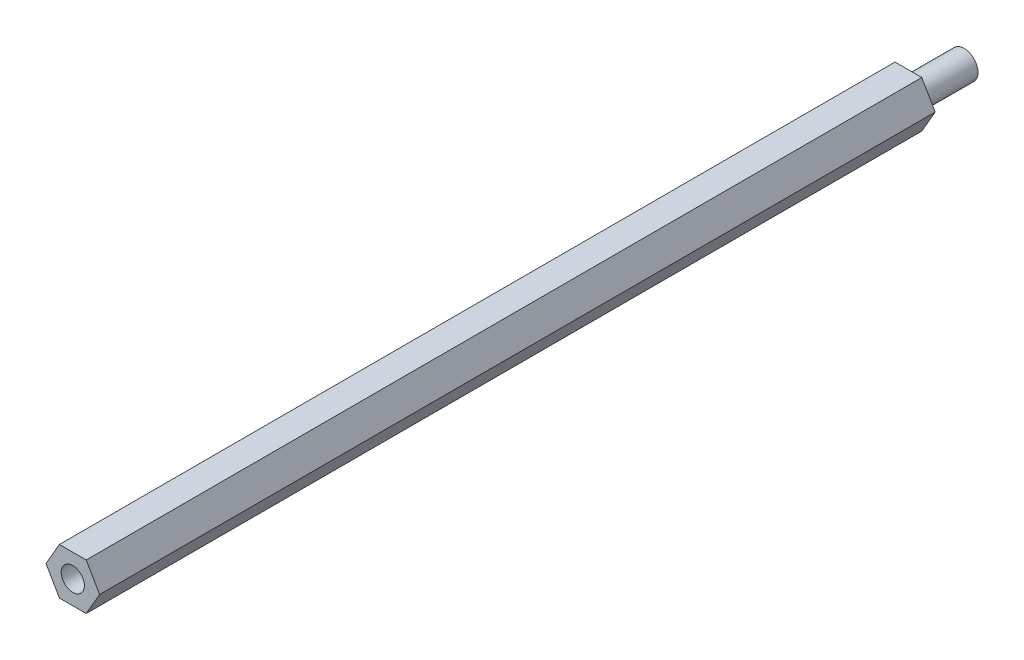
ISO-10303-21;
HEADER;
FILE_DESCRIPTION(('STEP AP214'),'2;1');
FILE_NAME('part.step','',(''),(''),'','','');
FILE_SCHEMA(('AUTOMOTIVE_DESIGN { 1 0 10303 214 1 1 1 1 }'));
ENDSEC;
DATA;
#1=APPLICATION_CONTEXT('core data for automotive mechanical design processes');
#2=APPLICATION_PROTOCOL_DEFINITION('international standard','automotive_design',2000,#1);
#3=PRODUCT_CONTEXT('',#1,'mechanical');
#4=PRODUCT('Part','Part','',(#3));
#5=PRODUCT_RELATED_PRODUCT_CATEGORY('part','',(#4));
#6=PRODUCT_DEFINITION_FORMATION('','',#4);
#7=PRODUCT_DEFINITION_CONTEXT('part definition',#1,'design');
#8=PRODUCT_DEFINITION('design','',#6,#7);
#9=PRODUCT_DEFINITION_SHAPE('','',#8);
#10=(LENGTH_UNIT() NAMED_UNIT(*) SI_UNIT(.MILLI.,.METRE.));
#11=(NAMED_UNIT(*) PLANE_ANGLE_UNIT() SI_UNIT($,.RADIAN.));
#12=(NAMED_UNIT(*) SI_UNIT($,.STERADIAN.) SOLID_ANGLE_UNIT());
#13=UNCERTAINTY_MEASURE_WITH_UNIT(LENGTH_MEASURE(1.E-05),#10,'distance_accuracy_value','');
#14=(GEOMETRIC_REPRESENTATION_CONTEXT(3) GLOBAL_UNCERTAINTY_ASSIGNED_CONTEXT((#13)) GLOBAL_UNIT_ASSIGNED_CONTEXT((#10,
#11,#12)) REPRESENTATION_CONTEXT('',''));
#15=CARTESIAN_POINT('',(0.,0.,0.));
#16=DIRECTION('',(0.,0.,1.));
#17=DIRECTION('',(1.,0.,0.));
#18=AXIS2_PLACEMENT_3D('',#15,#16,#17);
#19=CARTESIAN_POINT('',(1.44337567297406,2.5,90.));
#20=DIRECTION('',(0.,-1.,0.));
#21=DIRECTION('',(1.,0.,0.));
#22=AXIS2_PLACEMENT_3D('',#19,#20,#21);
#23=PLANE('',#22);
#24=DIRECTION('',(-1.,0.,0.));
#25=VECTOR('',#24,1.);
#26=CARTESIAN_POINT('',(1.44337567297406,2.5,0.));
#27=LINE('',#26,#25);
#28=CARTESIAN_POINT('',(1.44337567297406,2.5,0.));
#29=VERTEX_POINT('',#28);
#30=CARTESIAN_POINT('',(-1.44337567297407,2.5,0.));
#31=VERTEX_POINT('',#30);
#32=EDGE_CURVE('E121',#29,#31,#27,.T.);
#33=ORIENTED_EDGE('',*,*,#32,.T.);
#34=DIRECTION('',(0.,0.,-1.));
#35=VECTOR('',#34,1.);
#36=CARTESIAN_POINT('',(-1.44337567297407,2.5,90.));
#37=LINE('',#36,#35);
#38=CARTESIAN_POINT('',(-1.44337567297407,2.5,90.));
#39=VERTEX_POINT('',#38);
#40=EDGE_CURVE('E36',#39,#31,#37,.T.);
#41=ORIENTED_EDGE('',*,*,#40,.F.);
#42=DIRECTION('',(-1.,0.,0.));
#43=VECTOR('',#42,1.);
#44=CARTESIAN_POINT('',(1.44337567297406,2.5,90.));
#45=LINE('',#44,#43);
#46=CARTESIAN_POINT('',(1.44337567297406,2.5,90.));
#47=VERTEX_POINT('',#46);
#48=EDGE_CURVE('E132',#47,#39,#45,.T.);
#49=ORIENTED_EDGE('',*,*,#48,.F.);
#50=DIRECTION('',(0.,0.,-1.));
#51=VECTOR('',#50,1.);
#52=CARTESIAN_POINT('',(1.44337567297406,2.5,90.));
#53=LINE('',#52,#51);
#54=EDGE_CURVE('E117',#47,#29,#53,.T.);
#55=ORIENTED_EDGE('',*,*,#54,.T.);
#56=EDGE_LOOP('',(#33,#41,#49,#55));
#57=FACE_BOUND('',#56,.T.);
#58=ADVANCED_FACE('F33',(#57),#23,.F.);
#59=CARTESIAN_POINT('',(-1.44337567297407,2.5,90.));
#60=DIRECTION('',(0.866025403784439,-0.5,0.));
#61=DIRECTION('',(0.5,0.866025403784439,0.));
#62=AXIS2_PLACEMENT_3D('',#59,#60,#61);
#63=PLANE('',#62);
#64=DIRECTION('',(-0.5,-0.866025403784439,0.));
#65=VECTOR('',#64,1.);
#66=CARTESIAN_POINT('',(-1.44337567297407,2.5,0.));
#67=LINE('',#66,#65);
#68=CARTESIAN_POINT('',(-2.88675134594813,0.,0.));
#69=VERTEX_POINT('',#68);
#70=EDGE_CURVE('E124',#31,#69,#67,.T.);
#71=ORIENTED_EDGE('',*,*,#70,.T.);
#72=DIRECTION('',(0.,0.,-1.));
#73=VECTOR('',#72,1.);
#74=CARTESIAN_POINT('',(-2.88675134594813,0.,90.));
#75=LINE('',#74,#73);
#76=CARTESIAN_POINT('',(-2.88675134594813,0.,90.));
#77=VERTEX_POINT('',#76);
#78=EDGE_CURVE('E135',#77,#69,#75,.T.);
#79=ORIENTED_EDGE('',*,*,#78,.F.);
#80=DIRECTION('',(-0.5,-0.866025403784439,0.));
#81=VECTOR('',#80,1.);
#82=CARTESIAN_POINT('',(-1.44337567297407,2.5,90.));
#83=LINE('',#82,#81);
#84=EDGE_CURVE('E89',#39,#77,#83,.T.);
#85=ORIENTED_EDGE('',*,*,#84,.F.);
#86=ORIENTED_EDGE('',*,*,#40,.T.);
#87=EDGE_LOOP('',(#71,#79,#85,#86));
#88=FACE_BOUND('',#87,.T.);
#89=ADVANCED_FACE('F140',(#88),#63,.F.);
#90=CARTESIAN_POINT('',(-2.88675134594813,0.,90.));
#91=DIRECTION('',(0.866025403784438,0.5,0.));
#92=DIRECTION('',(-0.500000000000001,0.866025403784438,0.));
#93=AXIS2_PLACEMENT_3D('',#90,#91,#92);
#94=PLANE('',#93);
#95=DIRECTION('',(0.5,-0.866025403784438,0.));
#96=VECTOR('',#95,1.);
#97=CARTESIAN_POINT('',(-2.88675134594813,0.,0.));
#98=LINE('',#97,#96);
#99=CARTESIAN_POINT('',(-1.44337567297406,-2.5,0.));
#100=VERTEX_POINT('',#99);
#101=EDGE_CURVE('E127',#69,#100,#98,.T.);
#102=ORIENTED_EDGE('',*,*,#101,.T.);
#103=DIRECTION('',(0.,0.,-1.));
#104=VECTOR('',#103,1.);
#105=CARTESIAN_POINT('',(-1.44337567297406,-2.5,90.));
#106=LINE('',#105,#104);
#107=CARTESIAN_POINT('',(-1.44337567297406,-2.5,90.));
#108=VERTEX_POINT('',#107);
#109=EDGE_CURVE('E112',#108,#100,#106,.T.);
#110=ORIENTED_EDGE('',*,*,#109,.F.);
#111=DIRECTION('',(0.5,-0.866025403784438,0.));
#112=VECTOR('',#111,1.);
#113=CARTESIAN_POINT('',(-2.88675134594813,0.,90.));
#114=LINE('',#113,#112);
#115=EDGE_CURVE('E103',#77,#108,#114,.T.);
#116=ORIENTED_EDGE('',*,*,#115,.F.);
#117=ORIENTED_EDGE('',*,*,#78,.T.);
#118=EDGE_LOOP('',(#102,#110,#116,#117));
#119=FACE_BOUND('',#118,.T.);
#120=ADVANCED_FACE('F146',(#119),#94,.F.);
#121=CARTESIAN_POINT('',(-1.44337567297406,-2.5,90.));
#122=DIRECTION('',(0.,1.,0.));
#123=DIRECTION('',(-1.,0.,0.));
#124=AXIS2_PLACEMENT_3D('',#121,#122,#123);
#125=PLANE('',#124);
#126=DIRECTION('',(1.,0.,0.));
#127=VECTOR('',#126,1.);
#128=CARTESIAN_POINT('',(-1.44337567297406,-2.5,0.));
#129=LINE('',#128,#127);
#130=CARTESIAN_POINT('',(1.44337567297407,-2.5,0.));
#131=VERTEX_POINT('',#130);
#132=EDGE_CURVE('E111',#100,#131,#129,.T.);
#133=ORIENTED_EDGE('',*,*,#132,.T.);
#134=DIRECTION('',(0.,0.,-1.));
#135=VECTOR('',#134,1.);
#136=CARTESIAN_POINT('',(1.44337567297407,-2.5,90.));
#137=LINE('',#136,#135);
#138=CARTESIAN_POINT('',(1.44337567297407,-2.5,90.));
#139=VERTEX_POINT('',#138);
#140=EDGE_CURVE('E108',#139,#131,#137,.T.);
#141=ORIENTED_EDGE('',*,*,#140,.F.);
#142=DIRECTION('',(1.,0.,0.));
#143=VECTOR('',#142,1.);
#144=CARTESIAN_POINT('',(-1.44337567297406,-2.5,90.));
#145=LINE('',#144,#143);
#146=EDGE_CURVE('E97',#108,#139,#145,.T.);
#147=ORIENTED_EDGE('',*,*,#146,.F.);
#148=ORIENTED_EDGE('',*,*,#109,.T.);
#149=EDGE_LOOP('',(#133,#141,#147,#148));
#150=FACE_BOUND('',#149,.T.);
#151=ADVANCED_FACE('F109',(#150),#125,.F.);
#152=CARTESIAN_POINT('',(1.44337567297407,-2.5,90.));
#153=DIRECTION('',(-0.866025403784439,0.5,0.));
#154=DIRECTION('',(-0.5,-0.866025403784439,0.));
#155=AXIS2_PLACEMENT_3D('',#152,#153,#154);
#156=PLANE('',#155);
#157=DIRECTION('',(0.5,0.866025403784439,0.));
#158=VECTOR('',#157,1.);
#159=CARTESIAN_POINT('',(1.44337567297407,-2.5,0.));
#160=LINE('',#159,#158);
#161=CARTESIAN_POINT('',(2.88675134594813,0.,0.));
#162=VERTEX_POINT('',#161);
#163=EDGE_CURVE('E74',#131,#162,#160,.T.);
#164=ORIENTED_EDGE('',*,*,#163,.T.);
#165=DIRECTION('',(0.,0.,-1.));
#166=VECTOR('',#165,1.);
#167=CARTESIAN_POINT('',(2.88675134594813,0.,90.));
#168=LINE('',#167,#166);
#169=CARTESIAN_POINT('',(2.88675134594813,0.,90.));
#170=VERTEX_POINT('',#169);
#171=EDGE_CURVE('E113',#170,#162,#168,.T.);
#172=ORIENTED_EDGE('',*,*,#171,.F.);
#173=DIRECTION('',(0.5,0.866025403784439,0.));
#174=VECTOR('',#173,1.);
#175=CARTESIAN_POINT('',(1.44337567297407,-2.5,90.));
#176=LINE('',#175,#174);
#177=EDGE_CURVE('E101',#139,#170,#176,.T.);
#178=ORIENTED_EDGE('',*,*,#177,.F.);
#179=ORIENTED_EDGE('',*,*,#140,.T.);
#180=EDGE_LOOP('',(#164,#172,#178,#179));
#181=FACE_BOUND('',#180,.T.);
#182=ADVANCED_FACE('F115',(#181),#156,.F.);
#183=CARTESIAN_POINT('',(2.88675134594813,0.,90.));
#184=DIRECTION('',(-0.866025403784439,-0.5,0.));
#185=DIRECTION('',(0.5,-0.866025403784439,0.));
#186=AXIS2_PLACEMENT_3D('',#183,#184,#185);
#187=PLANE('',#186);
#188=DIRECTION('',(-0.5,0.866025403784439,0.));
#189=VECTOR('',#188,1.);
#190=CARTESIAN_POINT('',(2.88675134594813,0.,0.));
#191=LINE('',#190,#189);
#192=EDGE_CURVE('E80',#162,#29,#191,.T.);
#193=ORIENTED_EDGE('',*,*,#192,.T.);
#194=ORIENTED_EDGE('',*,*,#54,.F.);
#195=DIRECTION('',(-0.5,0.866025403784439,0.));
#196=VECTOR('',#195,1.);
#197=CARTESIAN_POINT('',(2.88675134594813,0.,90.));
#198=LINE('',#197,#196);
#199=EDGE_CURVE('E50',#170,#47,#198,.T.);
#200=ORIENTED_EDGE('',*,*,#199,.F.);
#201=ORIENTED_EDGE('',*,*,#171,.T.);
#202=EDGE_LOOP('',(#193,#194,#200,#201));
#203=FACE_BOUND('',#202,.T.);
#204=ADVANCED_FACE('F162',(#203),#187,.F.);
#205=CARTESIAN_POINT('',(0.,0.,90.));
#206=DIRECTION('',(0.,0.,1.));
#207=DIRECTION('',(1.,0.,0.));
#208=AXIS2_PLACEMENT_3D('',#205,#206,#207);
#209=PLANE('',#208);
#210=CARTESIAN_POINT('',(0.,0.,90.));
#211=DIRECTION('',(0.,0.,1.));
#212=DIRECTION('',(1.,0.,0.));
#213=AXIS2_PLACEMENT_3D('',#210,#211,#212);
#214=CIRCLE('',#213,1.24999999999999);
#215=CARTESIAN_POINT('',(1.24999999999999,0.,90.));
#216=VERTEX_POINT('',#215);
#217=EDGE_CURVE('E155',#216,#216,#214,.T.);
#218=ORIENTED_EDGE('',*,*,#217,.F.);
#219=EDGE_LOOP('',(#218));
#220=FACE_BOUND('',#219,.T.);
#221=ORIENTED_EDGE('',*,*,#48,.T.);
#222=ORIENTED_EDGE('',*,*,#84,.T.);
#223=ORIENTED_EDGE('',*,*,#115,.T.);
#224=ORIENTED_EDGE('',*,*,#146,.T.);
#225=ORIENTED_EDGE('',*,*,#177,.T.);
#226=ORIENTED_EDGE('',*,*,#199,.T.);
#227=EDGE_LOOP('',(#221,#222,#223,#224,#225,#226));
#228=FACE_BOUND('',#227,.T.);
#229=ADVANCED_FACE('F99',(#220,#228),#209,.T.);
#230=CARTESIAN_POINT('',(0.,0.,0.));
#231=DIRECTION('',(0.,0.,1.));
#232=DIRECTION('',(1.,0.,0.));
#233=AXIS2_PLACEMENT_3D('',#230,#231,#232);
#234=PLANE('',#233);
#235=CARTESIAN_POINT('',(0.,0.,0.));
#236=DIRECTION('',(0.,0.,-1.));
#237=DIRECTION('',(-1.,0.,0.));
#238=AXIS2_PLACEMENT_3D('',#235,#236,#237);
#239=CIRCLE('',#238,1.5);
#240=CARTESIAN_POINT('',(-1.5,0.,0.));
#241=VERTEX_POINT('',#240);
#242=EDGE_CURVE('E11',#241,#241,#239,.T.);
#243=ORIENTED_EDGE('',*,*,#242,.F.);
#244=EDGE_LOOP('',(#243));
#245=FACE_BOUND('',#244,.T.);
#246=ORIENTED_EDGE('',*,*,#32,.F.);
#247=ORIENTED_EDGE('',*,*,#192,.F.);
#248=ORIENTED_EDGE('',*,*,#163,.F.);
#249=ORIENTED_EDGE('',*,*,#132,.F.);
#250=ORIENTED_EDGE('',*,*,#101,.F.);
#251=ORIENTED_EDGE('',*,*,#70,.F.);
#252=EDGE_LOOP('',(#246,#247,#248,#249,#250,#251));
#253=FACE_BOUND('',#252,.T.);
#254=ADVANCED_FACE('F145',(#245,#253),#234,.F.);
#255=CARTESIAN_POINT('',(0.,0.,-6.));
#256=DIRECTION('',(0.,0.,1.));
#257=DIRECTION('',(1.,0.,0.));
#258=AXIS2_PLACEMENT_3D('',#255,#256,#257);
#259=CYLINDRICAL_SURFACE('',#258,1.5);
#260=CARTESIAN_POINT('',(0.,0.,-6.));
#261=DIRECTION('',(0.,0.,-1.));
#262=DIRECTION('',(-1.,0.,0.));
#263=AXIS2_PLACEMENT_3D('',#260,#261,#262);
#264=CIRCLE('',#263,1.5);
#265=CARTESIAN_POINT('',(-1.5,0.,-6.));
#266=VERTEX_POINT('',#265);
#267=EDGE_CURVE('E125',#266,#266,#264,.T.);
#268=ORIENTED_EDGE('',*,*,#267,.F.);
#269=EDGE_LOOP('',(#268));
#270=FACE_BOUND('',#269,.T.);
#271=ORIENTED_EDGE('',*,*,#242,.T.);
#272=EDGE_LOOP('',(#271));
#273=FACE_BOUND('',#272,.T.);
#274=ADVANCED_FACE('F168',(#270,#273),#259,.T.);
#275=CARTESIAN_POINT('',(0.,0.,-6.));
#276=DIRECTION('',(0.,0.,-1.));
#277=DIRECTION('',(-1.,0.,0.));
#278=AXIS2_PLACEMENT_3D('',#275,#276,#277);
#279=PLANE('',#278);
#280=ORIENTED_EDGE('',*,*,#267,.T.);
#281=EDGE_LOOP('',(#280));
#282=FACE_BOUND('',#281,.T.);
#283=ADVANCED_FACE('F209',(#282),#279,.T.);
#284=CARTESIAN_POINT('',(0.,0.,82.5));
#285=DIRECTION('',(0.,0.,1.));
#286=DIRECTION('',(1.,0.,0.));
#287=AXIS2_PLACEMENT_3D('',#284,#285,#286);
#288=CONICAL_SURFACE('',#287,1.25,1.02974425867666);
#289=CARTESIAN_POINT('',(0.,0.,81.7489242262155));
#290=VERTEX_POINT('',#289);
#291=VERTEX_LOOP('',#290);
#292=FACE_BOUND('',#291,.T.);
#293=CARTESIAN_POINT('',(0.,0.,82.5));
#294=DIRECTION('',(0.,0.,1.));
#295=DIRECTION('',(1.,0.,0.));
#296=AXIS2_PLACEMENT_3D('',#293,#294,#295);
#297=CIRCLE('',#296,1.25);
#298=CARTESIAN_POINT('',(1.25,0.,82.5));
#299=VERTEX_POINT('',#298);
#300=EDGE_CURVE('E152',#299,#299,#297,.T.);
#301=ORIENTED_EDGE('',*,*,#300,.T.);
#302=EDGE_LOOP('',(#301));
#303=FACE_BOUND('',#302,.T.);
#304=ADVANCED_FACE('F217',(#292,#303),#288,.F.);
#305=CARTESIAN_POINT('',(0.,0.,90.));
#306=DIRECTION('',(0.,0.,1.));
#307=DIRECTION('',(1.,0.,0.));
#308=AXIS2_PLACEMENT_3D('',#305,#306,#307);
#309=CYLINDRICAL_SURFACE('',#308,1.24999999999999);
#310=ORIENTED_EDGE('',*,*,#300,.F.);
#311=EDGE_LOOP('',(#310));
#312=FACE_BOUND('',#311,.T.);
#313=ORIENTED_EDGE('',*,*,#217,.T.);
#314=EDGE_LOOP('',(#313));
#315=FACE_BOUND('',#314,.T.);
#316=ADVANCED_FACE('F159',(#312,#315),#309,.F.);
#317=CLOSED_SHELL('',(#58,#89,#120,#151,#182,#204,#229,#254,#274,#283,#304,#316));
#318=MANIFOLD_SOLID_BREP('B2',#317);
#319=ADVANCED_BREP_SHAPE_REPRESENTATION('',(#18,#318),#14);
#320=SHAPE_DEFINITION_REPRESENTATION(#9,#319);
ENDSEC;
END-ISO-10303-21;
